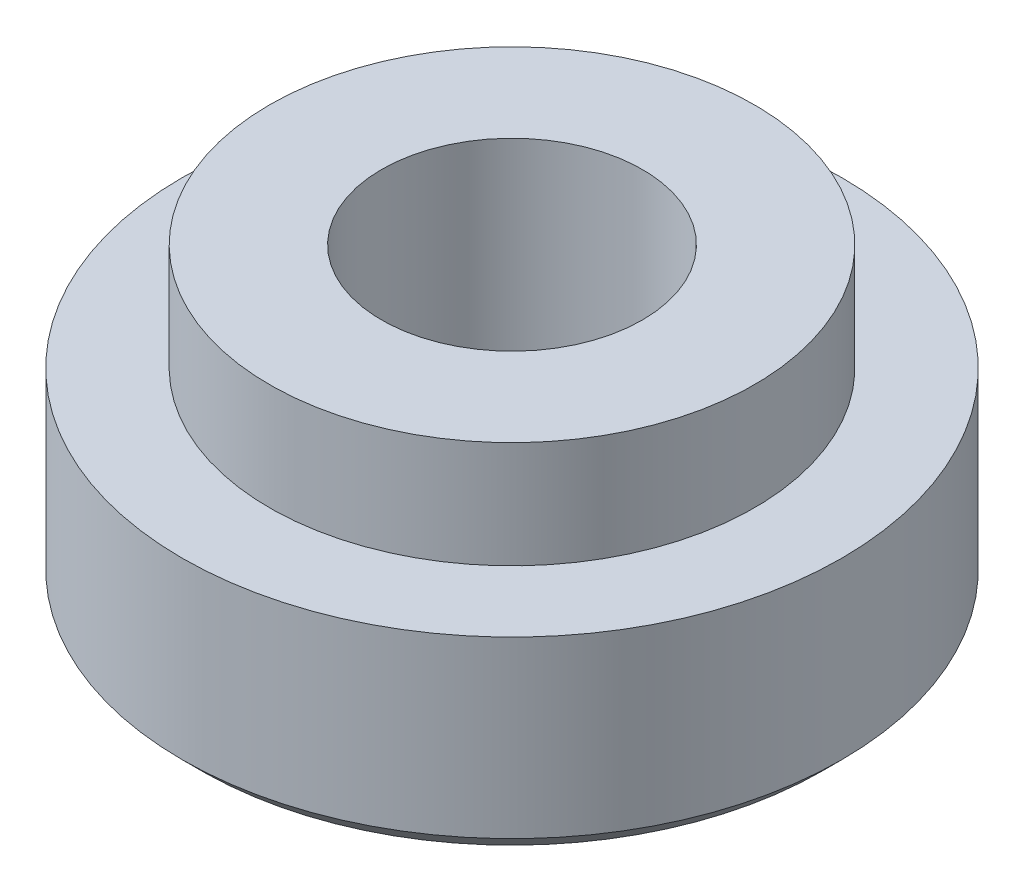
ISO-10303-21;
HEADER;
FILE_DESCRIPTION(('STEP AP214'),'2;1');
FILE_NAME('part.step','',(''),(''),'','','');
FILE_SCHEMA(('AUTOMOTIVE_DESIGN { 1 0 10303 214 1 1 1 1 }'));
ENDSEC;
DATA;
#1=APPLICATION_CONTEXT('core data for automotive mechanical design processes');
#2=APPLICATION_PROTOCOL_DEFINITION('international standard','automotive_design',2000,#1);
#3=PRODUCT_CONTEXT('',#1,'mechanical');
#4=PRODUCT('Part','Part','',(#3));
#5=PRODUCT_RELATED_PRODUCT_CATEGORY('part','',(#4));
#6=PRODUCT_DEFINITION_FORMATION('','',#4);
#7=PRODUCT_DEFINITION_CONTEXT('part definition',#1,'design');
#8=PRODUCT_DEFINITION('design','',#6,#7);
#9=PRODUCT_DEFINITION_SHAPE('','',#8);
#10=(LENGTH_UNIT() NAMED_UNIT(*) SI_UNIT(.MILLI.,.METRE.));
#11=(NAMED_UNIT(*) PLANE_ANGLE_UNIT() SI_UNIT($,.RADIAN.));
#12=(NAMED_UNIT(*) SI_UNIT($,.STERADIAN.) SOLID_ANGLE_UNIT());
#13=UNCERTAINTY_MEASURE_WITH_UNIT(LENGTH_MEASURE(1.E-05),#10,'distance_accuracy_value','');
#14=(GEOMETRIC_REPRESENTATION_CONTEXT(3) GLOBAL_UNCERTAINTY_ASSIGNED_CONTEXT((#13)) GLOBAL_UNIT_ASSIGNED_CONTEXT((#10,
#11,#12)) REPRESENTATION_CONTEXT('',''));
#15=CARTESIAN_POINT('',(0.,0.,0.));
#16=DIRECTION('',(0.,0.,1.));
#17=DIRECTION('',(1.,0.,0.));
#18=AXIS2_PLACEMENT_3D('',#15,#16,#17);
#19=CARTESIAN_POINT('',(3.175,3.937,0.));
#20=DIRECTION('',(0.,1.,0.));
#21=DIRECTION('',(1.,0.,0.));
#22=AXIS2_PLACEMENT_3D('',#19,#20,#21);
#23=PLANE('',#22);
#24=CARTESIAN_POINT('',(0.,3.937,0.));
#25=DIRECTION('',(0.,-1.,0.));
#26=DIRECTION('',(1.,0.,0.));
#27=AXIS2_PLACEMENT_3D('',#24,#25,#26);
#28=CIRCLE('',#27,1.70815);
#29=CARTESIAN_POINT('',(-1.70815,3.937,0.));
#30=VERTEX_POINT('',#29);
#31=EDGE_CURVE('E11',#30,#30,#28,.T.);
#32=ORIENTED_EDGE('',*,*,#31,.T.);
#33=EDGE_LOOP('',(#32));
#34=FACE_BOUND('',#33,.T.);
#35=CARTESIAN_POINT('',(0.,3.937,0.));
#36=DIRECTION('',(0.,-1.,0.));
#37=DIRECTION('',(1.,0.,0.));
#38=AXIS2_PLACEMENT_3D('',#35,#36,#37);
#39=CIRCLE('',#38,3.175);
#40=CARTESIAN_POINT('',(-3.175,3.937,0.));
#41=VERTEX_POINT('',#40);
#42=EDGE_CURVE('E87',#41,#41,#39,.T.);
#43=ORIENTED_EDGE('',*,*,#42,.F.);
#44=EDGE_LOOP('',(#43));
#45=FACE_BOUND('',#44,.T.);
#46=ADVANCED_FACE('F16',(#34,#45),#23,.T.);
#47=CARTESIAN_POINT('',(0.,1.9685,0.));
#48=DIRECTION('',(0.,-1.,0.));
#49=DIRECTION('',(1.,0.,0.));
#50=AXIS2_PLACEMENT_3D('',#47,#48,#49);
#51=CYLINDRICAL_SURFACE('',#50,1.70815);
#52=CARTESIAN_POINT('',(0.,0.,0.));
#53=DIRECTION('',(0.,-1.,0.));
#54=DIRECTION('',(1.,0.,0.));
#55=AXIS2_PLACEMENT_3D('',#52,#53,#54);
#56=CIRCLE('',#55,1.70815);
#57=CARTESIAN_POINT('',(-1.70815,0.,0.));
#58=VERTEX_POINT('',#57);
#59=EDGE_CURVE('E69',#58,#58,#56,.T.);
#60=ORIENTED_EDGE('',*,*,#59,.T.);
#61=DIRECTION('',(0.,1.,0.));
#62=VECTOR('',#61,1.);
#63=CARTESIAN_POINT('',(-1.70815,1.9685,0.));
#64=LINE('',#63,#62);
#65=EDGE_CURVE('E26',#58,#30,#64,.T.);
#66=ORIENTED_EDGE('',*,*,#65,.T.);
#67=ORIENTED_EDGE('',*,*,#31,.F.);
#68=ORIENTED_EDGE('',*,*,#65,.F.);
#69=EDGE_LOOP('',(#60,#66,#67,#68));
#70=FACE_BOUND('',#69,.T.);
#71=ADVANCED_FACE('F18',(#70),#51,.F.);
#72=CARTESIAN_POINT('',(4.318,2.54,0.));
#73=DIRECTION('',(0.,1.,0.));
#74=DIRECTION('',(1.,0.,0.));
#75=AXIS2_PLACEMENT_3D('',#72,#73,#74);
#76=PLANE('',#75);
#77=CARTESIAN_POINT('',(0.,2.54,0.));
#78=DIRECTION('',(0.,-1.,0.));
#79=DIRECTION('',(1.,0.,0.));
#80=AXIS2_PLACEMENT_3D('',#77,#78,#79);
#81=CIRCLE('',#80,3.175);
#82=CARTESIAN_POINT('',(-3.175,2.54,0.));
#83=VERTEX_POINT('',#82);
#84=EDGE_CURVE('E77',#83,#83,#81,.T.);
#85=ORIENTED_EDGE('',*,*,#84,.T.);
#86=EDGE_LOOP('',(#85));
#87=FACE_BOUND('',#86,.T.);
#88=CARTESIAN_POINT('',(0.,2.54,0.));
#89=DIRECTION('',(0.,-1.,0.));
#90=DIRECTION('',(1.,0.,0.));
#91=AXIS2_PLACEMENT_3D('',#88,#89,#90);
#92=CIRCLE('',#91,4.318);
#93=CARTESIAN_POINT('',(-4.318,2.54,0.));
#94=VERTEX_POINT('',#93);
#95=EDGE_CURVE('E62',#94,#94,#92,.T.);
#96=ORIENTED_EDGE('',*,*,#95,.F.);
#97=EDGE_LOOP('',(#96));
#98=FACE_BOUND('',#97,.T.);
#99=ADVANCED_FACE('F121',(#87,#98),#76,.T.);
#100=CARTESIAN_POINT('',(0.,3.2385,0.));
#101=DIRECTION('',(0.,-1.,0.));
#102=DIRECTION('',(1.,0.,0.));
#103=AXIS2_PLACEMENT_3D('',#100,#101,#102);
#104=CYLINDRICAL_SURFACE('',#103,3.175);
#105=ORIENTED_EDGE('',*,*,#84,.F.);
#106=DIRECTION('',(0.,1.,0.));
#107=VECTOR('',#106,1.);
#108=CARTESIAN_POINT('',(-3.175,3.2385,0.));
#109=LINE('',#108,#107);
#110=EDGE_CURVE('E91',#83,#41,#109,.T.);
#111=ORIENTED_EDGE('',*,*,#110,.T.);
#112=ORIENTED_EDGE('',*,*,#42,.T.);
#113=ORIENTED_EDGE('',*,*,#110,.F.);
#114=EDGE_LOOP('',(#105,#111,#112,#113));
#115=FACE_BOUND('',#114,.T.);
#116=ADVANCED_FACE('F118',(#115),#104,.T.);
#117=CARTESIAN_POINT('',(1.905,0.,0.));
#118=DIRECTION('',(0.,-1.,0.));
#119=DIRECTION('',(0.,0.,-1.));
#120=AXIS2_PLACEMENT_3D('',#117,#118,#119);
#121=PLANE('',#120);
#122=ORIENTED_EDGE('',*,*,#59,.F.);
#123=EDGE_LOOP('',(#122));
#124=FACE_BOUND('',#123,.T.);
#125=CARTESIAN_POINT('',(0.,0.,0.));
#126=DIRECTION('',(0.,1.,0.));
#127=DIRECTION('',(-1.,0.,0.));
#128=AXIS2_PLACEMENT_3D('',#125,#126,#127);
#129=CIRCLE('',#128,4.064);
#130=CARTESIAN_POINT('',(4.064,0.,0.));
#131=VERTEX_POINT('',#130);
#132=EDGE_CURVE('E95',#131,#131,#129,.T.);
#133=ORIENTED_EDGE('',*,*,#132,.F.);
#134=EDGE_LOOP('',(#133));
#135=FACE_BOUND('',#134,.T.);
#136=ADVANCED_FACE('F129',(#124,#135),#121,.T.);
#137=CARTESIAN_POINT('',(0.,1.27,0.));
#138=DIRECTION('',(0.,-1.,0.));
#139=DIRECTION('',(1.,0.,0.));
#140=AXIS2_PLACEMENT_3D('',#137,#138,#139);
#141=CYLINDRICAL_SURFACE('',#140,4.318);
#142=CARTESIAN_POINT('',(0.,0.254000000000006,0.));
#143=DIRECTION('',(0.,-1.,0.));
#144=DIRECTION('',(-1.,0.,0.));
#145=AXIS2_PLACEMENT_3D('',#142,#143,#144);
#146=CIRCLE('',#145,4.318);
#147=CARTESIAN_POINT('',(4.318,0.254000000000006,0.));
#148=VERTEX_POINT('',#147);
#149=CARTESIAN_POINT('',(-4.318,0.254000000000006,0.));
#150=VERTEX_POINT('',#149);
#151=EDGE_CURVE('E82',#148,#150,#146,.T.);
#152=ORIENTED_EDGE('',*,*,#151,.F.);
#153=CARTESIAN_POINT('',(0.,0.254000000000006,0.));
#154=DIRECTION('',(0.,-1.,0.));
#155=DIRECTION('',(-1.,0.,0.));
#156=AXIS2_PLACEMENT_3D('',#153,#154,#155);
#157=CIRCLE('',#156,4.318);
#158=EDGE_CURVE('E79',#150,#148,#157,.T.);
#159=ORIENTED_EDGE('',*,*,#158,.F.);
#160=DIRECTION('',(0.,1.,0.));
#161=VECTOR('',#160,1.);
#162=CARTESIAN_POINT('',(-4.318,1.27,0.));
#163=LINE('',#162,#161);
#164=EDGE_CURVE('E65',#150,#94,#163,.T.);
#165=ORIENTED_EDGE('',*,*,#164,.T.);
#166=ORIENTED_EDGE('',*,*,#95,.T.);
#167=ORIENTED_EDGE('',*,*,#164,.F.);
#168=EDGE_LOOP('',(#152,#159,#165,#166,#167));
#169=FACE_BOUND('',#168,.T.);
#170=ADVANCED_FACE('F64',(#169),#141,.T.);
#171=CARTESIAN_POINT('',(0.,0.127000000000004,0.));
#172=DIRECTION('',(0.,1.,0.));
#173=DIRECTION('',(-1.,0.,0.));
#174=AXIS2_PLACEMENT_3D('',#171,#172,#173);
#175=CONICAL_SURFACE('',#174,4.191,0.785398163397441);
#176=ORIENTED_EDGE('',*,*,#132,.T.);
#177=DIRECTION('',(0.707106781186542,0.707106781186553,0.));
#178=VECTOR('',#177,1.);
#179=CARTESIAN_POINT('',(4.191,0.127000000000004,0.));
#180=LINE('',#179,#178);
#181=EDGE_CURVE('E92',#131,#148,#180,.T.);
#182=ORIENTED_EDGE('',*,*,#181,.T.);
#183=ORIENTED_EDGE('',*,*,#151,.T.);
#184=ORIENTED_EDGE('',*,*,#158,.T.);
#185=ORIENTED_EDGE('',*,*,#181,.F.);
#186=EDGE_LOOP('',(#176,#182,#183,#184,#185));
#187=FACE_BOUND('',#186,.T.);
#188=ADVANCED_FACE('F140',(#187),#175,.T.);
#189=CLOSED_SHELL('',(#46,#71,#99,#116,#136,#170,#188));
#190=MANIFOLD_SOLID_BREP('B1',#189);
#191=ADVANCED_BREP_SHAPE_REPRESENTATION('',(#18,#190),#14);
#192=SHAPE_DEFINITION_REPRESENTATION(#9,#191);
ENDSEC;
END-ISO-10303-21;
